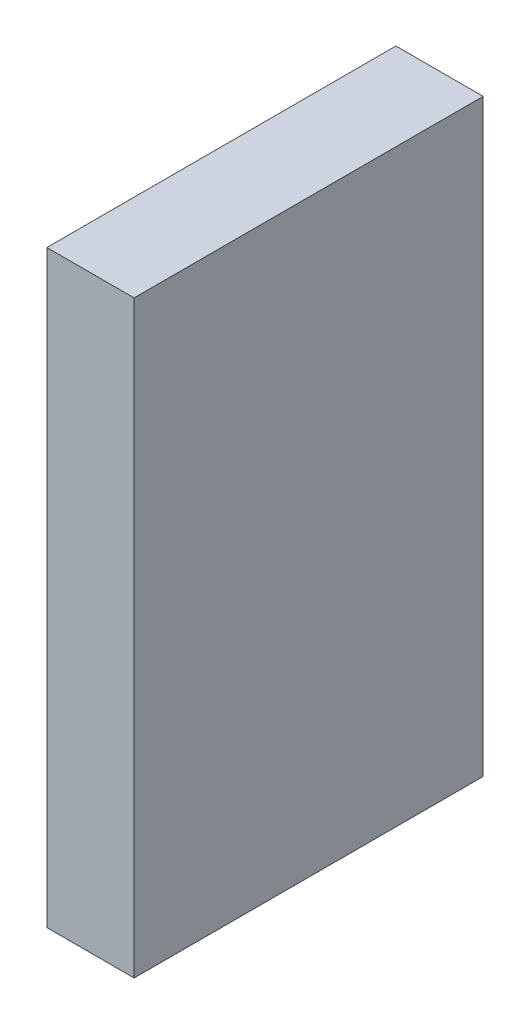
ISO-10303-21;
HEADER;
FILE_DESCRIPTION(('STEP AP214'),'2;1');
FILE_NAME('part.step','',(''),(''),'','','');
FILE_SCHEMA(('AUTOMOTIVE_DESIGN { 1 0 10303 214 1 1 1 1 }'));
ENDSEC;
DATA;
#1=APPLICATION_CONTEXT('core data for automotive mechanical design processes');
#2=APPLICATION_PROTOCOL_DEFINITION('international standard','automotive_design',2000,#1);
#3=PRODUCT_CONTEXT('',#1,'mechanical');
#4=PRODUCT('Part','Part','',(#3));
#5=PRODUCT_RELATED_PRODUCT_CATEGORY('part','',(#4));
#6=PRODUCT_DEFINITION_FORMATION('','',#4);
#7=PRODUCT_DEFINITION_CONTEXT('part definition',#1,'design');
#8=PRODUCT_DEFINITION('design','',#6,#7);
#9=PRODUCT_DEFINITION_SHAPE('','',#8);
#10=(LENGTH_UNIT() NAMED_UNIT(*) SI_UNIT(.MILLI.,.METRE.));
#11=(NAMED_UNIT(*) PLANE_ANGLE_UNIT() SI_UNIT($,.RADIAN.));
#12=(NAMED_UNIT(*) SI_UNIT($,.STERADIAN.) SOLID_ANGLE_UNIT());
#13=UNCERTAINTY_MEASURE_WITH_UNIT(LENGTH_MEASURE(1.E-05),#10,'distance_accuracy_value','');
#14=(GEOMETRIC_REPRESENTATION_CONTEXT(3) GLOBAL_UNCERTAINTY_ASSIGNED_CONTEXT((#13)) GLOBAL_UNIT_ASSIGNED_CONTEXT((#10,
#11,#12)) REPRESENTATION_CONTEXT('',''));
#15=CARTESIAN_POINT('',(0.,0.,0.));
#16=DIRECTION('',(0.,0.,1.));
#17=DIRECTION('',(1.,0.,0.));
#18=AXIS2_PLACEMENT_3D('',#15,#16,#17);
#19=CARTESIAN_POINT('',(2.,-6.75,-4.));
#20=DIRECTION('',(0.,0.,1.));
#21=DIRECTION('',(1.,0.,0.));
#22=AXIS2_PLACEMENT_3D('',#19,#20,#21);
#23=PLANE('',#22);
#24=DIRECTION('',(0.,1.,0.));
#25=VECTOR('',#24,1.);
#26=CARTESIAN_POINT('',(0.,-6.75,-4.));
#27=LINE('',#26,#25);
#28=CARTESIAN_POINT('',(0.,-6.75,-4.));
#29=VERTEX_POINT('',#28);
#30=CARTESIAN_POINT('',(0.,6.75,-4.));
#31=VERTEX_POINT('',#30);
#32=EDGE_CURVE('E99',#29,#31,#27,.T.);
#33=ORIENTED_EDGE('',*,*,#32,.T.);
#34=DIRECTION('',(-1.,0.,0.));
#35=VECTOR('',#34,1.);
#36=CARTESIAN_POINT('',(2.,6.75,-4.));
#37=LINE('',#36,#35);
#38=CARTESIAN_POINT('',(2.,6.75,-4.));
#39=VERTEX_POINT('',#38);
#40=EDGE_CURVE('E11',#39,#31,#37,.T.);
#41=ORIENTED_EDGE('',*,*,#40,.F.);
#42=DIRECTION('',(0.,1.,0.));
#43=VECTOR('',#42,1.);
#44=CARTESIAN_POINT('',(2.,-6.75,-4.));
#45=LINE('',#44,#43);
#46=CARTESIAN_POINT('',(2.,-6.75,-4.));
#47=VERTEX_POINT('',#46);
#48=EDGE_CURVE('E87',#47,#39,#45,.T.);
#49=ORIENTED_EDGE('',*,*,#48,.F.);
#50=DIRECTION('',(-1.,0.,0.));
#51=VECTOR('',#50,1.);
#52=CARTESIAN_POINT('',(2.,-6.75,-4.));
#53=LINE('',#52,#51);
#54=EDGE_CURVE('E95',#47,#29,#53,.T.);
#55=ORIENTED_EDGE('',*,*,#54,.T.);
#56=EDGE_LOOP('',(#33,#41,#49,#55));
#57=FACE_BOUND('',#56,.T.);
#58=ADVANCED_FACE('F36',(#57),#23,.F.);
#59=CARTESIAN_POINT('',(2.,6.75,4.));
#60=DIRECTION('',(0.,-1.,0.));
#61=DIRECTION('',(0.,0.,-1.));
#62=AXIS2_PLACEMENT_3D('',#59,#60,#61);
#63=PLANE('',#62);
#64=DIRECTION('',(0.,0.,1.));
#65=VECTOR('',#64,1.);
#66=CARTESIAN_POINT('',(0.,6.75,4.));
#67=LINE('',#66,#65);
#68=CARTESIAN_POINT('',(0.,6.75,4.));
#69=VERTEX_POINT('',#68);
#70=EDGE_CURVE('E91',#31,#69,#67,.T.);
#71=ORIENTED_EDGE('',*,*,#70,.T.);
#72=DIRECTION('',(-1.,0.,0.));
#73=VECTOR('',#72,1.);
#74=CARTESIAN_POINT('',(2.,6.75,4.));
#75=LINE('',#74,#73);
#76=CARTESIAN_POINT('',(2.,6.75,4.));
#77=VERTEX_POINT('',#76);
#78=EDGE_CURVE('E44',#77,#69,#75,.T.);
#79=ORIENTED_EDGE('',*,*,#78,.F.);
#80=DIRECTION('',(0.,0.,1.));
#81=VECTOR('',#80,1.);
#82=CARTESIAN_POINT('',(2.,6.75,4.));
#83=LINE('',#82,#81);
#84=EDGE_CURVE('E82',#39,#77,#83,.T.);
#85=ORIENTED_EDGE('',*,*,#84,.F.);
#86=ORIENTED_EDGE('',*,*,#40,.T.);
#87=EDGE_LOOP('',(#71,#79,#85,#86));
#88=FACE_BOUND('',#87,.T.);
#89=ADVANCED_FACE('F90',(#88),#63,.F.);
#90=CARTESIAN_POINT('',(2.,-6.75,4.));
#91=DIRECTION('',(0.,0.,-1.));
#92=DIRECTION('',(-1.,0.,0.));
#93=AXIS2_PLACEMENT_3D('',#90,#91,#92);
#94=PLANE('',#93);
#95=DIRECTION('',(0.,-1.,0.));
#96=VECTOR('',#95,1.);
#97=CARTESIAN_POINT('',(0.,-6.75,4.));
#98=LINE('',#97,#96);
#99=CARTESIAN_POINT('',(0.,-6.75,4.));
#100=VERTEX_POINT('',#99);
#101=EDGE_CURVE('E69',#69,#100,#98,.T.);
#102=ORIENTED_EDGE('',*,*,#101,.T.);
#103=DIRECTION('',(-1.,0.,0.));
#104=VECTOR('',#103,1.);
#105=CARTESIAN_POINT('',(2.,-6.75,4.));
#106=LINE('',#105,#104);
#107=CARTESIAN_POINT('',(2.,-6.75,4.));
#108=VERTEX_POINT('',#107);
#109=EDGE_CURVE('E92',#108,#100,#106,.T.);
#110=ORIENTED_EDGE('',*,*,#109,.F.);
#111=DIRECTION('',(0.,-1.,0.));
#112=VECTOR('',#111,1.);
#113=CARTESIAN_POINT('',(2.,-6.75,4.));
#114=LINE('',#113,#112);
#115=EDGE_CURVE('E85',#77,#108,#114,.T.);
#116=ORIENTED_EDGE('',*,*,#115,.F.);
#117=ORIENTED_EDGE('',*,*,#78,.T.);
#118=EDGE_LOOP('',(#102,#110,#116,#117));
#119=FACE_BOUND('',#118,.T.);
#120=ADVANCED_FACE('F93',(#119),#94,.F.);
#121=CARTESIAN_POINT('',(2.,-6.75,4.));
#122=DIRECTION('',(0.,1.,0.));
#123=DIRECTION('',(0.,0.,1.));
#124=AXIS2_PLACEMENT_3D('',#121,#122,#123);
#125=PLANE('',#124);
#126=DIRECTION('',(0.,0.,-1.));
#127=VECTOR('',#126,1.);
#128=CARTESIAN_POINT('',(0.,-6.75,4.));
#129=LINE('',#128,#127);
#130=EDGE_CURVE('E75',#100,#29,#129,.T.);
#131=ORIENTED_EDGE('',*,*,#130,.T.);
#132=ORIENTED_EDGE('',*,*,#54,.F.);
#133=DIRECTION('',(0.,0.,-1.));
#134=VECTOR('',#133,1.);
#135=CARTESIAN_POINT('',(2.,-6.75,4.));
#136=LINE('',#135,#134);
#137=EDGE_CURVE('E52',#108,#47,#136,.T.);
#138=ORIENTED_EDGE('',*,*,#137,.F.);
#139=ORIENTED_EDGE('',*,*,#109,.T.);
#140=EDGE_LOOP('',(#131,#132,#138,#139));
#141=FACE_BOUND('',#140,.T.);
#142=ADVANCED_FACE('F106',(#141),#125,.F.);
#143=CARTESIAN_POINT('',(2.,0.,0.));
#144=DIRECTION('',(-1.,0.,0.));
#145=DIRECTION('',(0.,0.,1.));
#146=AXIS2_PLACEMENT_3D('',#143,#144,#145);
#147=PLANE('',#146);
#148=ORIENTED_EDGE('',*,*,#48,.T.);
#149=ORIENTED_EDGE('',*,*,#84,.T.);
#150=ORIENTED_EDGE('',*,*,#115,.T.);
#151=ORIENTED_EDGE('',*,*,#137,.T.);
#152=EDGE_LOOP('',(#148,#149,#150,#151));
#153=FACE_BOUND('',#152,.T.);
#154=ADVANCED_FACE('F83',(#153),#147,.F.);
#155=CARTESIAN_POINT('',(0.,0.,0.));
#156=DIRECTION('',(-1.,0.,0.));
#157=DIRECTION('',(0.,0.,1.));
#158=AXIS2_PLACEMENT_3D('',#155,#156,#157);
#159=PLANE('',#158);
#160=ORIENTED_EDGE('',*,*,#32,.F.);
#161=ORIENTED_EDGE('',*,*,#130,.F.);
#162=ORIENTED_EDGE('',*,*,#101,.F.);
#163=ORIENTED_EDGE('',*,*,#70,.F.);
#164=EDGE_LOOP('',(#160,#161,#162,#163));
#165=FACE_BOUND('',#164,.T.);
#166=ADVANCED_FACE('F109',(#165),#159,.T.);
#167=CLOSED_SHELL('',(#58,#89,#120,#142,#154,#166));
#168=MANIFOLD_SOLID_BREP('B2',#167);
#169=ADVANCED_BREP_SHAPE_REPRESENTATION('',(#18,#168),#14);
#170=SHAPE_DEFINITION_REPRESENTATION(#9,#169);
ENDSEC;
END-ISO-10303-21;
